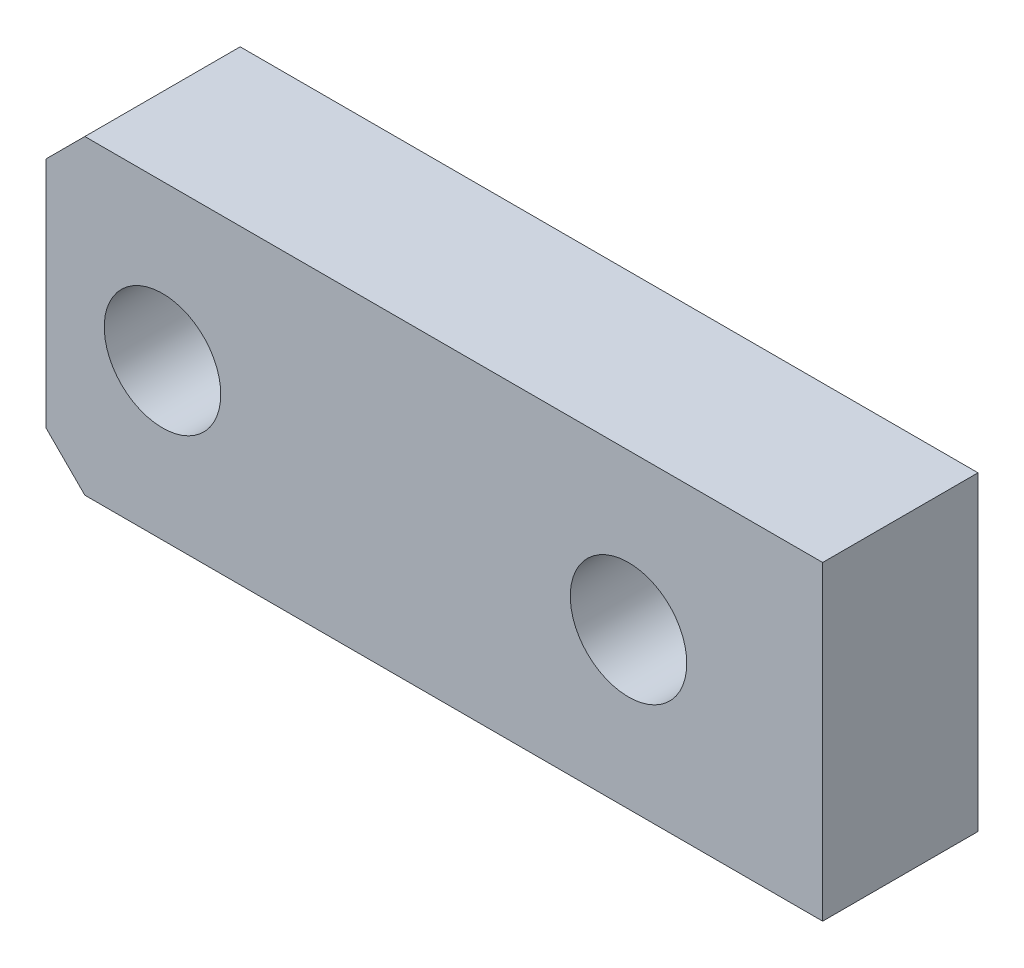
ISO-10303-21;
HEADER;
FILE_DESCRIPTION(('STEP AP214'),'2;1');
FILE_NAME('part.step','',(''),(''),'','','');
FILE_SCHEMA(('AUTOMOTIVE_DESIGN { 1 0 10303 214 1 1 1 1 }'));
ENDSEC;
DATA;
#1=APPLICATION_CONTEXT('core data for automotive mechanical design processes');
#2=APPLICATION_PROTOCOL_DEFINITION('international standard','automotive_design',2000,#1);
#3=PRODUCT_CONTEXT('',#1,'mechanical');
#4=PRODUCT('Part','Part','',(#3));
#5=PRODUCT_RELATED_PRODUCT_CATEGORY('part','',(#4));
#6=PRODUCT_DEFINITION_FORMATION('','',#4);
#7=PRODUCT_DEFINITION_CONTEXT('part definition',#1,'design');
#8=PRODUCT_DEFINITION('design','',#6,#7);
#9=PRODUCT_DEFINITION_SHAPE('','',#8);
#10=(LENGTH_UNIT() NAMED_UNIT(*) SI_UNIT(.MILLI.,.METRE.));
#11=(NAMED_UNIT(*) PLANE_ANGLE_UNIT() SI_UNIT($,.RADIAN.));
#12=(NAMED_UNIT(*) SI_UNIT($,.STERADIAN.) SOLID_ANGLE_UNIT());
#13=UNCERTAINTY_MEASURE_WITH_UNIT(LENGTH_MEASURE(1.E-05),#10,'distance_accuracy_value','');
#14=(GEOMETRIC_REPRESENTATION_CONTEXT(3) GLOBAL_UNCERTAINTY_ASSIGNED_CONTEXT((#13)) GLOBAL_UNIT_ASSIGNED_CONTEXT((#10,
#11,#12)) REPRESENTATION_CONTEXT('',''));
#15=CARTESIAN_POINT('',(0.,0.,0.));
#16=DIRECTION('',(0.,0.,1.));
#17=DIRECTION('',(1.,0.,0.));
#18=AXIS2_PLACEMENT_3D('',#15,#16,#17);
#19=CARTESIAN_POINT('',(10.,4.,4.));
#20=DIRECTION('',(-1.,0.,0.));
#21=DIRECTION('',(0.,-1.,0.));
#22=AXIS2_PLACEMENT_3D('',#19,#20,#21);
#23=PLANE('',#22);
#24=DIRECTION('',(0.,1.,0.));
#25=VECTOR('',#24,1.);
#26=CARTESIAN_POINT('',(10.,4.,0.));
#27=LINE('',#26,#25);
#28=CARTESIAN_POINT('',(10.,-4.,0.));
#29=VERTEX_POINT('',#28);
#30=CARTESIAN_POINT('',(10.,4.,0.));
#31=VERTEX_POINT('',#30);
#32=EDGE_CURVE('E106',#29,#31,#27,.T.);
#33=ORIENTED_EDGE('',*,*,#32,.T.);
#34=DIRECTION('',(0.,0.,-1.));
#35=VECTOR('',#34,1.);
#36=CARTESIAN_POINT('',(10.,4.,4.));
#37=LINE('',#36,#35);
#38=CARTESIAN_POINT('',(10.,4.,4.));
#39=VERTEX_POINT('',#38);
#40=EDGE_CURVE('E89',#39,#31,#37,.T.);
#41=ORIENTED_EDGE('',*,*,#40,.F.);
#42=DIRECTION('',(0.,1.,0.));
#43=VECTOR('',#42,1.);
#44=CARTESIAN_POINT('',(10.,4.,4.));
#45=LINE('',#44,#43);
#46=CARTESIAN_POINT('',(10.,-4.,4.));
#47=VERTEX_POINT('',#46);
#48=EDGE_CURVE('E94',#47,#39,#45,.T.);
#49=ORIENTED_EDGE('',*,*,#48,.F.);
#50=DIRECTION('',(0.,0.,-1.));
#51=VECTOR('',#50,1.);
#52=CARTESIAN_POINT('',(10.,-4.,4.));
#53=LINE('',#52,#51);
#54=EDGE_CURVE('E108',#47,#29,#53,.T.);
#55=ORIENTED_EDGE('',*,*,#54,.T.);
#56=EDGE_LOOP('',(#33,#41,#49,#55));
#57=FACE_BOUND('',#56,.T.);
#58=ADVANCED_FACE('F33',(#57),#23,.F.);
#59=CARTESIAN_POINT('',(-10.,4.,4.));
#60=DIRECTION('',(0.,-1.,0.));
#61=DIRECTION('',(0.,0.,-1.));
#62=AXIS2_PLACEMENT_3D('',#59,#60,#61);
#63=PLANE('',#62);
#64=DIRECTION('',(-1.,0.,0.));
#65=VECTOR('',#64,1.);
#66=CARTESIAN_POINT('',(-10.,4.,0.));
#67=LINE('',#66,#65);
#68=CARTESIAN_POINT('',(-9.,4.,0.));
#69=VERTEX_POINT('',#68);
#70=EDGE_CURVE('E138',#31,#69,#67,.T.);
#71=ORIENTED_EDGE('',*,*,#70,.T.);
#72=DIRECTION('',(0.,0.,1.));
#73=VECTOR('',#72,1.);
#74=CARTESIAN_POINT('',(-9.,4.,4.));
#75=LINE('',#74,#73);
#76=CARTESIAN_POINT('',(-9.,4.,4.));
#77=VERTEX_POINT('',#76);
#78=EDGE_CURVE('E11',#69,#77,#75,.T.);
#79=ORIENTED_EDGE('',*,*,#78,.T.);
#80=DIRECTION('',(-1.,0.,0.));
#81=VECTOR('',#80,1.);
#82=CARTESIAN_POINT('',(-10.,4.,4.));
#83=LINE('',#82,#81);
#84=EDGE_CURVE('E85',#39,#77,#83,.T.);
#85=ORIENTED_EDGE('',*,*,#84,.F.);
#86=ORIENTED_EDGE('',*,*,#40,.T.);
#87=EDGE_LOOP('',(#71,#79,#85,#86));
#88=FACE_BOUND('',#87,.T.);
#89=ADVANCED_FACE('F87',(#88),#63,.F.);
#90=CARTESIAN_POINT('',(-10.,4.,4.));
#91=DIRECTION('',(1.,0.,0.));
#92=DIRECTION('',(0.,0.,-1.));
#93=AXIS2_PLACEMENT_3D('',#90,#91,#92);
#94=PLANE('',#93);
#95=DIRECTION('',(0.,-1.,0.));
#96=VECTOR('',#95,1.);
#97=CARTESIAN_POINT('',(-10.,4.,0.));
#98=LINE('',#97,#96);
#99=CARTESIAN_POINT('',(-10.,3.,0.));
#100=VERTEX_POINT('',#99);
#101=CARTESIAN_POINT('',(-10.,-3.,0.));
#102=VERTEX_POINT('',#101);
#103=EDGE_CURVE('E135',#100,#102,#98,.T.);
#104=ORIENTED_EDGE('',*,*,#103,.T.);
#105=DIRECTION('',(0.,0.,1.));
#106=VECTOR('',#105,1.);
#107=CARTESIAN_POINT('',(-10.,-3.,4.));
#108=LINE('',#107,#106);
#109=CARTESIAN_POINT('',(-10.,-3.,4.));
#110=VERTEX_POINT('',#109);
#111=EDGE_CURVE('E54',#102,#110,#108,.T.);
#112=ORIENTED_EDGE('',*,*,#111,.T.);
#113=DIRECTION('',(0.,-1.,0.));
#114=VECTOR('',#113,1.);
#115=CARTESIAN_POINT('',(-10.,4.,4.));
#116=LINE('',#115,#114);
#117=CARTESIAN_POINT('',(-10.,3.,4.));
#118=VERTEX_POINT('',#117);
#119=EDGE_CURVE('E93',#118,#110,#116,.T.);
#120=ORIENTED_EDGE('',*,*,#119,.F.);
#121=DIRECTION('',(0.,0.,-1.));
#122=VECTOR('',#121,1.);
#123=CARTESIAN_POINT('',(-10.,3.,4.));
#124=LINE('',#123,#122);
#125=EDGE_CURVE('E119',#118,#100,#124,.T.);
#126=ORIENTED_EDGE('',*,*,#125,.T.);
#127=EDGE_LOOP('',(#104,#112,#120,#126));
#128=FACE_BOUND('',#127,.T.);
#129=ADVANCED_FACE('F136',(#128),#94,.F.);
#130=CARTESIAN_POINT('',(-10.,-4.,4.));
#131=DIRECTION('',(0.,1.,0.));
#132=DIRECTION('',(0.,0.,1.));
#133=AXIS2_PLACEMENT_3D('',#130,#131,#132);
#134=PLANE('',#133);
#135=DIRECTION('',(1.,0.,0.));
#136=VECTOR('',#135,1.);
#137=CARTESIAN_POINT('',(-10.,-4.,4.));
#138=LINE('',#137,#136);
#139=CARTESIAN_POINT('',(-9.,-4.,4.));
#140=VERTEX_POINT('',#139);
#141=EDGE_CURVE('E99',#140,#47,#138,.T.);
#142=ORIENTED_EDGE('',*,*,#141,.F.);
#143=DIRECTION('',(0.,0.,-1.));
#144=VECTOR('',#143,1.);
#145=CARTESIAN_POINT('',(-9.,-4.,4.));
#146=LINE('',#145,#144);
#147=CARTESIAN_POINT('',(-9.,-4.,0.));
#148=VERTEX_POINT('',#147);
#149=EDGE_CURVE('E107',#140,#148,#146,.T.);
#150=ORIENTED_EDGE('',*,*,#149,.T.);
#151=DIRECTION('',(1.,0.,0.));
#152=VECTOR('',#151,1.);
#153=CARTESIAN_POINT('',(-10.,-4.,0.));
#154=LINE('',#153,#152);
#155=EDGE_CURVE('E103',#148,#29,#154,.T.);
#156=ORIENTED_EDGE('',*,*,#155,.T.);
#157=ORIENTED_EDGE('',*,*,#54,.F.);
#158=EDGE_LOOP('',(#142,#150,#156,#157));
#159=FACE_BOUND('',#158,.T.);
#160=ADVANCED_FACE('F128',(#159),#134,.F.);
#161=CARTESIAN_POINT('',(0.,0.,4.));
#162=DIRECTION('',(0.,0.,1.));
#163=DIRECTION('',(1.,0.,0.));
#164=AXIS2_PLACEMENT_3D('',#161,#162,#163);
#165=PLANE('',#164);
#166=CARTESIAN_POINT('',(5.,0.,4.));
#167=DIRECTION('',(0.,0.,1.));
#168=DIRECTION('',(1.,0.,0.));
#169=AXIS2_PLACEMENT_3D('',#166,#167,#168);
#170=CIRCLE('',#169,1.5);
#171=CARTESIAN_POINT('',(6.5,0.,4.));
#172=VERTEX_POINT('',#171);
#173=EDGE_CURVE('E151',#172,#172,#170,.T.);
#174=ORIENTED_EDGE('',*,*,#173,.F.);
#175=EDGE_LOOP('',(#174));
#176=FACE_BOUND('',#175,.T.);
#177=CARTESIAN_POINT('',(-7.,0.,4.));
#178=DIRECTION('',(0.,0.,1.));
#179=DIRECTION('',(1.,0.,0.));
#180=AXIS2_PLACEMENT_3D('',#177,#178,#179);
#181=CIRCLE('',#180,1.5);
#182=CARTESIAN_POINT('',(-5.5,0.,4.));
#183=VERTEX_POINT('',#182);
#184=EDGE_CURVE('E145',#183,#183,#181,.T.);
#185=ORIENTED_EDGE('',*,*,#184,.F.);
#186=EDGE_LOOP('',(#185));
#187=FACE_BOUND('',#186,.T.);
#188=ORIENTED_EDGE('',*,*,#119,.T.);
#189=DIRECTION('',(-0.707106781186547,0.707106781186548,0.));
#190=VECTOR('',#189,1.);
#191=CARTESIAN_POINT('',(-6.50000000000001,-6.5,4.));
#192=LINE('',#191,#190);
#193=EDGE_CURVE('E41',#110,#140,#192,.F.);
#194=ORIENTED_EDGE('',*,*,#193,.T.);
#195=ORIENTED_EDGE('',*,*,#141,.T.);
#196=ORIENTED_EDGE('',*,*,#48,.T.);
#197=ORIENTED_EDGE('',*,*,#84,.T.);
#198=DIRECTION('',(0.707106781186548,0.707106781186547,0.));
#199=VECTOR('',#198,1.);
#200=CARTESIAN_POINT('',(-6.49999999999999,6.5,4.));
#201=LINE('',#200,#199);
#202=EDGE_CURVE('E123',#77,#118,#201,.F.);
#203=ORIENTED_EDGE('',*,*,#202,.T.);
#204=EDGE_LOOP('',(#188,#194,#195,#196,#197,#203));
#205=FACE_BOUND('',#204,.T.);
#206=ADVANCED_FACE('F97',(#176,#187,#205),#165,.T.);
#207=CARTESIAN_POINT('',(0.,0.,0.));
#208=DIRECTION('',(0.,0.,1.));
#209=DIRECTION('',(1.,0.,0.));
#210=AXIS2_PLACEMENT_3D('',#207,#208,#209);
#211=PLANE('',#210);
#212=CARTESIAN_POINT('',(5.,0.,0.));
#213=DIRECTION('',(0.,0.,1.));
#214=DIRECTION('',(1.,0.,0.));
#215=AXIS2_PLACEMENT_3D('',#212,#213,#214);
#216=CIRCLE('',#215,1.5);
#217=CARTESIAN_POINT('',(6.5,0.,0.));
#218=VERTEX_POINT('',#217);
#219=EDGE_CURVE('E148',#218,#218,#216,.T.);
#220=ORIENTED_EDGE('',*,*,#219,.T.);
#221=EDGE_LOOP('',(#220));
#222=FACE_BOUND('',#221,.T.);
#223=CARTESIAN_POINT('',(-7.,0.,0.));
#224=DIRECTION('',(0.,0.,1.));
#225=DIRECTION('',(1.,0.,0.));
#226=AXIS2_PLACEMENT_3D('',#223,#224,#225);
#227=CIRCLE('',#226,1.5);
#228=CARTESIAN_POINT('',(-5.5,0.,0.));
#229=VERTEX_POINT('',#228);
#230=EDGE_CURVE('E142',#229,#229,#227,.T.);
#231=ORIENTED_EDGE('',*,*,#230,.T.);
#232=EDGE_LOOP('',(#231));
#233=FACE_BOUND('',#232,.T.);
#234=ORIENTED_EDGE('',*,*,#155,.F.);
#235=DIRECTION('',(0.707106781186547,-0.707106781186548,0.));
#236=VECTOR('',#235,1.);
#237=CARTESIAN_POINT('',(-9.,-4.,0.));
#238=LINE('',#237,#236);
#239=EDGE_CURVE('E117',#148,#102,#238,.F.);
#240=ORIENTED_EDGE('',*,*,#239,.T.);
#241=ORIENTED_EDGE('',*,*,#103,.F.);
#242=DIRECTION('',(-0.707106781186548,-0.707106781186547,0.));
#243=VECTOR('',#242,1.);
#244=CARTESIAN_POINT('',(-10.,3.,0.));
#245=LINE('',#244,#243);
#246=EDGE_CURVE('E111',#100,#69,#245,.F.);
#247=ORIENTED_EDGE('',*,*,#246,.T.);
#248=ORIENTED_EDGE('',*,*,#70,.F.);
#249=ORIENTED_EDGE('',*,*,#32,.F.);
#250=EDGE_LOOP('',(#234,#240,#241,#247,#248,#249));
#251=FACE_BOUND('',#250,.T.);
#252=ADVANCED_FACE('F134',(#222,#233,#251),#211,.F.);
#253=CARTESIAN_POINT('',(-9.,-4.,4.));
#254=DIRECTION('',(0.707106781186548,0.707106781186547,0.));
#255=DIRECTION('',(0.,0.,-1.));
#256=AXIS2_PLACEMENT_3D('',#253,#254,#255);
#257=PLANE('',#256);
#258=ORIENTED_EDGE('',*,*,#193,.F.);
#259=ORIENTED_EDGE('',*,*,#111,.F.);
#260=ORIENTED_EDGE('',*,*,#239,.F.);
#261=ORIENTED_EDGE('',*,*,#149,.F.);
#262=EDGE_LOOP('',(#258,#259,#260,#261));
#263=FACE_BOUND('',#262,.T.);
#264=ADVANCED_FACE('F131',(#263),#257,.F.);
#265=CARTESIAN_POINT('',(-10.,3.,4.));
#266=DIRECTION('',(0.707106781186547,-0.707106781186548,0.));
#267=DIRECTION('',(0.,0.,-1.));
#268=AXIS2_PLACEMENT_3D('',#265,#266,#267);
#269=PLANE('',#268);
#270=ORIENTED_EDGE('',*,*,#202,.F.);
#271=ORIENTED_EDGE('',*,*,#78,.F.);
#272=ORIENTED_EDGE('',*,*,#246,.F.);
#273=ORIENTED_EDGE('',*,*,#125,.F.);
#274=EDGE_LOOP('',(#270,#271,#272,#273));
#275=FACE_BOUND('',#274,.T.);
#276=ADVANCED_FACE('F35',(#275),#269,.F.);
#277=CARTESIAN_POINT('',(-7.,0.,0.));
#278=DIRECTION('',(0.,0.,1.));
#279=DIRECTION('',(1.,0.,0.));
#280=AXIS2_PLACEMENT_3D('',#277,#278,#279);
#281=CYLINDRICAL_SURFACE('',#280,1.5);
#282=ORIENTED_EDGE('',*,*,#230,.F.);
#283=EDGE_LOOP('',(#282));
#284=FACE_BOUND('',#283,.T.);
#285=ORIENTED_EDGE('',*,*,#184,.T.);
#286=EDGE_LOOP('',(#285));
#287=FACE_BOUND('',#286,.T.);
#288=ADVANCED_FACE('F162',(#284,#287),#281,.F.);
#289=CARTESIAN_POINT('',(5.,0.,0.));
#290=DIRECTION('',(0.,0.,1.));
#291=DIRECTION('',(1.,0.,0.));
#292=AXIS2_PLACEMENT_3D('',#289,#290,#291);
#293=CYLINDRICAL_SURFACE('',#292,1.5);
#294=ORIENTED_EDGE('',*,*,#219,.F.);
#295=EDGE_LOOP('',(#294));
#296=FACE_BOUND('',#295,.T.);
#297=ORIENTED_EDGE('',*,*,#173,.T.);
#298=EDGE_LOOP('',(#297));
#299=FACE_BOUND('',#298,.T.);
#300=ADVANCED_FACE('F159',(#296,#299),#293,.F.);
#301=CLOSED_SHELL('',(#58,#89,#129,#160,#206,#252,#264,#276,#288,#300));
#302=MANIFOLD_SOLID_BREP('B2',#301);
#303=ADVANCED_BREP_SHAPE_REPRESENTATION('',(#18,#302),#14);
#304=SHAPE_DEFINITION_REPRESENTATION(#9,#303);
ENDSEC;
END-ISO-10303-21;
